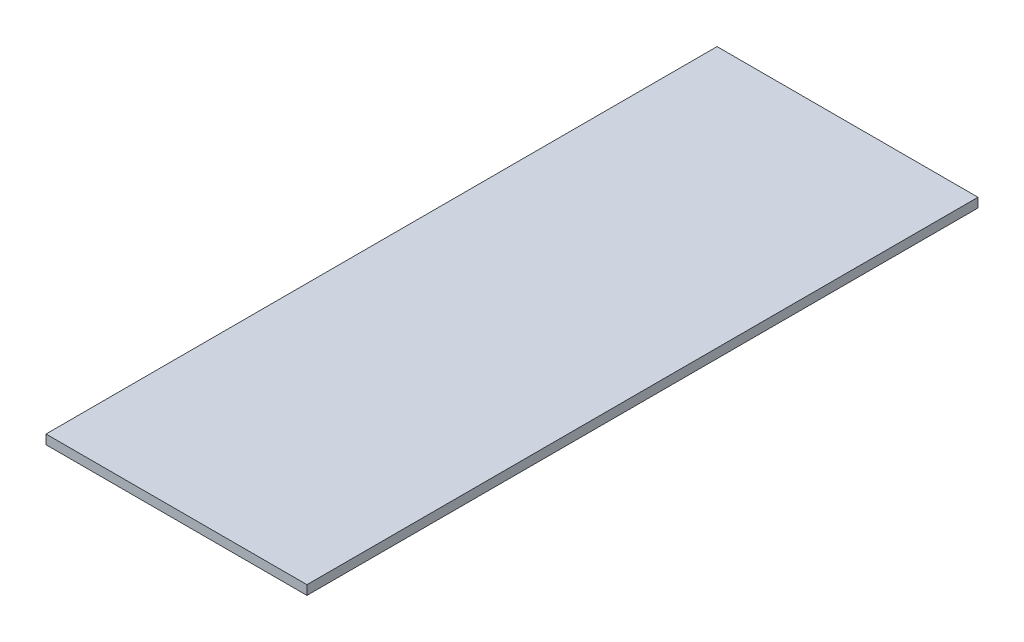
ISO-10303-21;
HEADER;
FILE_DESCRIPTION(('STEP AP214'),'2;1');
FILE_NAME('part.step','',(''),(''),'','','');
FILE_SCHEMA(('AUTOMOTIVE_DESIGN { 1 0 10303 214 1 1 1 1 }'));
ENDSEC;
DATA;
#1=APPLICATION_CONTEXT('core data for automotive mechanical design processes');
#2=APPLICATION_PROTOCOL_DEFINITION('international standard','automotive_design',2000,#1);
#3=PRODUCT_CONTEXT('',#1,'mechanical');
#4=PRODUCT('Part','Part','',(#3));
#5=PRODUCT_RELATED_PRODUCT_CATEGORY('part','',(#4));
#6=PRODUCT_DEFINITION_FORMATION('','',#4);
#7=PRODUCT_DEFINITION_CONTEXT('part definition',#1,'design');
#8=PRODUCT_DEFINITION('design','',#6,#7);
#9=PRODUCT_DEFINITION_SHAPE('','',#8);
#10=(LENGTH_UNIT() NAMED_UNIT(*) SI_UNIT(.MILLI.,.METRE.));
#11=(NAMED_UNIT(*) PLANE_ANGLE_UNIT() SI_UNIT($,.RADIAN.));
#12=(NAMED_UNIT(*) SI_UNIT($,.STERADIAN.) SOLID_ANGLE_UNIT());
#13=UNCERTAINTY_MEASURE_WITH_UNIT(LENGTH_MEASURE(1.E-05),#10,'distance_accuracy_value','');
#14=(GEOMETRIC_REPRESENTATION_CONTEXT(3) GLOBAL_UNCERTAINTY_ASSIGNED_CONTEXT((#13)) GLOBAL_UNIT_ASSIGNED_CONTEXT((#10,
#11,#12)) REPRESENTATION_CONTEXT('',''));
#15=CARTESIAN_POINT('',(0.,0.,0.));
#16=DIRECTION('',(0.,0.,1.));
#17=DIRECTION('',(1.,0.,0.));
#18=AXIS2_PLACEMENT_3D('',#15,#16,#17);
#19=CARTESIAN_POINT('',(-36.9372481238005,3.175,-30.1055940820945));
#20=DIRECTION('',(1.,0.,0.));
#21=DIRECTION('',(0.,0.,-1.));
#22=AXIS2_PLACEMENT_3D('',#19,#20,#21);
#23=PLANE('',#22);
#24=DIRECTION('',(0.,0.,1.));
#25=VECTOR('',#24,1.);
#26=CARTESIAN_POINT('',(-36.9372481238005,0.,-30.1055940820945));
#27=LINE('',#26,#25);
#28=CARTESIAN_POINT('',(-36.9372481238005,0.,-30.1055940820945));
#29=VERTEX_POINT('',#28);
#30=CARTESIAN_POINT('',(-36.9372481238005,0.,198.494405917906));
#31=VERTEX_POINT('',#30);
#32=EDGE_CURVE('E95',#29,#31,#27,.T.);
#33=ORIENTED_EDGE('',*,*,#32,.T.);
#34=DIRECTION('',(0.,-1.,0.));
#35=VECTOR('',#34,1.);
#36=CARTESIAN_POINT('',(-36.9372481238005,3.175,198.494405917906));
#37=LINE('',#36,#35);
#38=CARTESIAN_POINT('',(-36.9372481238005,3.175,198.494405917906));
#39=VERTEX_POINT('',#38);
#40=EDGE_CURVE('E11',#39,#31,#37,.T.);
#41=ORIENTED_EDGE('',*,*,#40,.F.);
#42=DIRECTION('',(0.,0.,1.));
#43=VECTOR('',#42,1.);
#44=CARTESIAN_POINT('',(-36.9372481238005,3.175,-30.1055940820945));
#45=LINE('',#44,#43);
#46=CARTESIAN_POINT('',(-36.9372481238005,3.175,-30.1055940820945));
#47=VERTEX_POINT('',#46);
#48=EDGE_CURVE('E83',#47,#39,#45,.T.);
#49=ORIENTED_EDGE('',*,*,#48,.F.);
#50=DIRECTION('',(0.,-1.,0.));
#51=VECTOR('',#50,1.);
#52=CARTESIAN_POINT('',(-36.9372481238005,3.175,-30.1055940820945));
#53=LINE('',#52,#51);
#54=EDGE_CURVE('E91',#47,#29,#53,.T.);
#55=ORIENTED_EDGE('',*,*,#54,.T.);
#56=EDGE_LOOP('',(#33,#41,#49,#55));
#57=FACE_BOUND('',#56,.T.);
#58=ADVANCED_FACE('F32',(#57),#23,.F.);
#59=CARTESIAN_POINT('',(-36.9372481238005,3.175,198.494405917906));
#60=DIRECTION('',(0.,0.,-1.));
#61=DIRECTION('',(-1.,0.,0.));
#62=AXIS2_PLACEMENT_3D('',#59,#60,#61);
#63=PLANE('',#62);
#64=DIRECTION('',(1.,0.,0.));
#65=VECTOR('',#64,1.);
#66=CARTESIAN_POINT('',(-36.9372481238005,0.,198.494405917906));
#67=LINE('',#66,#65);
#68=CARTESIAN_POINT('',(51.9627518761995,0.,198.494405917906));
#69=VERTEX_POINT('',#68);
#70=EDGE_CURVE('E87',#31,#69,#67,.T.);
#71=ORIENTED_EDGE('',*,*,#70,.T.);
#72=DIRECTION('',(0.,-1.,0.));
#73=VECTOR('',#72,1.);
#74=CARTESIAN_POINT('',(51.9627518761995,3.175,198.494405917906));
#75=LINE('',#74,#73);
#76=CARTESIAN_POINT('',(51.9627518761995,3.175,198.494405917906));
#77=VERTEX_POINT('',#76);
#78=EDGE_CURVE('E40',#77,#69,#75,.T.);
#79=ORIENTED_EDGE('',*,*,#78,.F.);
#80=DIRECTION('',(1.,0.,0.));
#81=VECTOR('',#80,1.);
#82=CARTESIAN_POINT('',(-36.9372481238005,3.175,198.494405917906));
#83=LINE('',#82,#81);
#84=EDGE_CURVE('E78',#39,#77,#83,.T.);
#85=ORIENTED_EDGE('',*,*,#84,.F.);
#86=ORIENTED_EDGE('',*,*,#40,.T.);
#87=EDGE_LOOP('',(#71,#79,#85,#86));
#88=FACE_BOUND('',#87,.T.);
#89=ADVANCED_FACE('F86',(#88),#63,.F.);
#90=CARTESIAN_POINT('',(51.9627518761995,3.175,-30.1055940820945));
#91=DIRECTION('',(-1.,0.,0.));
#92=DIRECTION('',(0.,0.,1.));
#93=AXIS2_PLACEMENT_3D('',#90,#91,#92);
#94=PLANE('',#93);
#95=DIRECTION('',(0.,0.,-1.));
#96=VECTOR('',#95,1.);
#97=CARTESIAN_POINT('',(51.9627518761995,0.,-30.1055940820945));
#98=LINE('',#97,#96);
#99=CARTESIAN_POINT('',(51.9627518761995,0.,-30.1055940820945));
#100=VERTEX_POINT('',#99);
#101=EDGE_CURVE('E65',#69,#100,#98,.T.);
#102=ORIENTED_EDGE('',*,*,#101,.T.);
#103=DIRECTION('',(0.,-1.,0.));
#104=VECTOR('',#103,1.);
#105=CARTESIAN_POINT('',(51.9627518761995,3.175,-30.1055940820945));
#106=LINE('',#105,#104);
#107=CARTESIAN_POINT('',(51.9627518761995,3.175,-30.1055940820945));
#108=VERTEX_POINT('',#107);
#109=EDGE_CURVE('E88',#108,#100,#106,.T.);
#110=ORIENTED_EDGE('',*,*,#109,.F.);
#111=DIRECTION('',(0.,0.,-1.));
#112=VECTOR('',#111,1.);
#113=CARTESIAN_POINT('',(51.9627518761995,3.175,-30.1055940820945));
#114=LINE('',#113,#112);
#115=EDGE_CURVE('E81',#77,#108,#114,.T.);
#116=ORIENTED_EDGE('',*,*,#115,.F.);
#117=ORIENTED_EDGE('',*,*,#78,.T.);
#118=EDGE_LOOP('',(#102,#110,#116,#117));
#119=FACE_BOUND('',#118,.T.);
#120=ADVANCED_FACE('F89',(#119),#94,.F.);
#121=CARTESIAN_POINT('',(-36.9372481238005,3.175,-30.1055940820945));
#122=DIRECTION('',(0.,0.,1.));
#123=DIRECTION('',(1.,0.,0.));
#124=AXIS2_PLACEMENT_3D('',#121,#122,#123);
#125=PLANE('',#124);
#126=DIRECTION('',(-1.,0.,0.));
#127=VECTOR('',#126,1.);
#128=CARTESIAN_POINT('',(-36.9372481238005,0.,-30.1055940820945));
#129=LINE('',#128,#127);
#130=EDGE_CURVE('E71',#100,#29,#129,.T.);
#131=ORIENTED_EDGE('',*,*,#130,.T.);
#132=ORIENTED_EDGE('',*,*,#54,.F.);
#133=DIRECTION('',(-1.,0.,0.));
#134=VECTOR('',#133,1.);
#135=CARTESIAN_POINT('',(-36.9372481238005,3.175,-30.1055940820945));
#136=LINE('',#135,#134);
#137=EDGE_CURVE('E48',#108,#47,#136,.T.);
#138=ORIENTED_EDGE('',*,*,#137,.F.);
#139=ORIENTED_EDGE('',*,*,#109,.T.);
#140=EDGE_LOOP('',(#131,#132,#138,#139));
#141=FACE_BOUND('',#140,.T.);
#142=ADVANCED_FACE('F102',(#141),#125,.F.);
#143=CARTESIAN_POINT('',(0.,3.175,0.));
#144=DIRECTION('',(0.,1.,0.));
#145=DIRECTION('',(0.,0.,1.));
#146=AXIS2_PLACEMENT_3D('',#143,#144,#145);
#147=PLANE('',#146);
#148=ORIENTED_EDGE('',*,*,#48,.T.);
#149=ORIENTED_EDGE('',*,*,#84,.T.);
#150=ORIENTED_EDGE('',*,*,#115,.T.);
#151=ORIENTED_EDGE('',*,*,#137,.T.);
#152=EDGE_LOOP('',(#148,#149,#150,#151));
#153=FACE_BOUND('',#152,.T.);
#154=ADVANCED_FACE('F79',(#153),#147,.T.);
#155=CARTESIAN_POINT('',(0.,0.,0.));
#156=DIRECTION('',(0.,1.,0.));
#157=DIRECTION('',(0.,0.,1.));
#158=AXIS2_PLACEMENT_3D('',#155,#156,#157);
#159=PLANE('',#158);
#160=ORIENTED_EDGE('',*,*,#32,.F.);
#161=ORIENTED_EDGE('',*,*,#130,.F.);
#162=ORIENTED_EDGE('',*,*,#101,.F.);
#163=ORIENTED_EDGE('',*,*,#70,.F.);
#164=EDGE_LOOP('',(#160,#161,#162,#163));
#165=FACE_BOUND('',#164,.T.);
#166=ADVANCED_FACE('F105',(#165),#159,.F.);
#167=CLOSED_SHELL('',(#58,#89,#120,#142,#154,#166));
#168=MANIFOLD_SOLID_BREP('B2',#167);
#169=ADVANCED_BREP_SHAPE_REPRESENTATION('',(#18,#168),#14);
#170=SHAPE_DEFINITION_REPRESENTATION(#9,#169);
ENDSEC;
END-ISO-10303-21;
